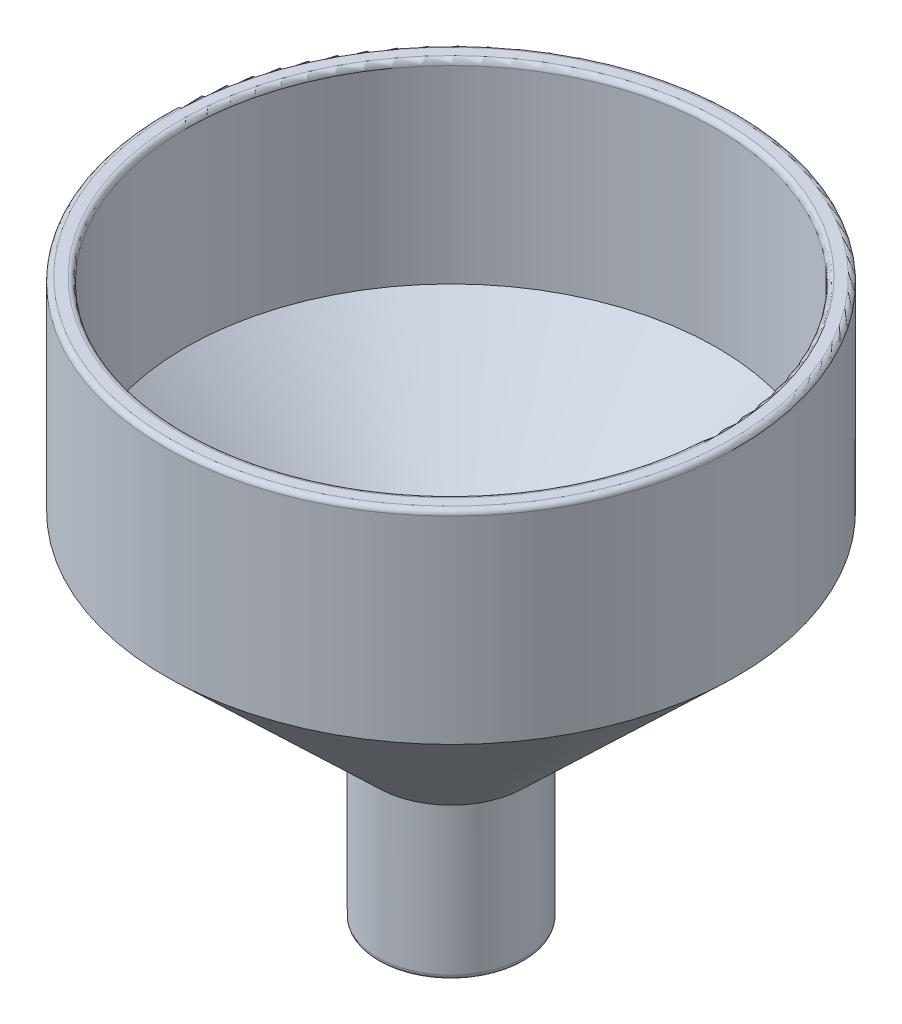
ISO-10303-21;
HEADER;
FILE_DESCRIPTION(('STEP AP214'),'2;1');
FILE_NAME('part.step','',(''),(''),'','','');
FILE_SCHEMA(('AUTOMOTIVE_DESIGN { 1 0 10303 214 1 1 1 1 }'));
ENDSEC;
DATA;
#1=APPLICATION_CONTEXT('core data for automotive mechanical design processes');
#2=APPLICATION_PROTOCOL_DEFINITION('international standard','automotive_design',2000,#1);
#3=PRODUCT_CONTEXT('',#1,'mechanical');
#4=PRODUCT('Part','Part','',(#3));
#5=PRODUCT_RELATED_PRODUCT_CATEGORY('part','',(#4));
#6=PRODUCT_DEFINITION_FORMATION('','',#4);
#7=PRODUCT_DEFINITION_CONTEXT('part definition',#1,'design');
#8=PRODUCT_DEFINITION('design','',#6,#7);
#9=PRODUCT_DEFINITION_SHAPE('','',#8);
#10=(LENGTH_UNIT() NAMED_UNIT(*) SI_UNIT(.MILLI.,.METRE.));
#11=(NAMED_UNIT(*) PLANE_ANGLE_UNIT() SI_UNIT($,.RADIAN.));
#12=(NAMED_UNIT(*) SI_UNIT($,.STERADIAN.) SOLID_ANGLE_UNIT());
#13=UNCERTAINTY_MEASURE_WITH_UNIT(LENGTH_MEASURE(1.E-05),#10,'distance_accuracy_value','');
#14=(GEOMETRIC_REPRESENTATION_CONTEXT(3) GLOBAL_UNCERTAINTY_ASSIGNED_CONTEXT((#13)) GLOBAL_UNIT_ASSIGNED_CONTEXT((#10,
#11,#12)) REPRESENTATION_CONTEXT('',''));
#15=CARTESIAN_POINT('',(0.,0.,0.));
#16=DIRECTION('',(0.,0.,1.));
#17=DIRECTION('',(1.,0.,0.));
#18=AXIS2_PLACEMENT_3D('',#15,#16,#17);
#19=CARTESIAN_POINT('',(-7.25,15.0833069396014,0.));
#20=DIRECTION('',(0.,1.,0.));
#21=DIRECTION('',(0.,0.,1.));
#22=AXIS2_PLACEMENT_3D('',#19,#20,#21);
#23=PLANE('',#22);
#24=CARTESIAN_POINT('',(0.,15.0833069396014,0.));
#25=DIRECTION('',(0.,1.,0.));
#26=DIRECTION('',(0.,0.,1.));
#27=AXIS2_PLACEMENT_3D('',#24,#25,#26);
#28=CIRCLE('',#27,5.75);
#29=CARTESIAN_POINT('',(0.,15.0833069396014,5.75));
#30=VERTEX_POINT('',#29);
#31=EDGE_CURVE('E53',#30,#30,#28,.T.);
#32=ORIENTED_EDGE('',*,*,#31,.T.);
#33=EDGE_LOOP('',(#32));
#34=FACE_BOUND('',#33,.T.);
#35=CARTESIAN_POINT('',(0.,15.0833069396014,0.));
#36=DIRECTION('',(0.,1.,0.));
#37=DIRECTION('',(0.,0.,1.));
#38=AXIS2_PLACEMENT_3D('',#35,#36,#37);
#39=CIRCLE('',#38,6.75);
#40=CARTESIAN_POINT('',(0.,15.0833069396014,6.75));
#41=VERTEX_POINT('',#40);
#42=EDGE_CURVE('E56',#41,#41,#39,.F.);
#43=ORIENTED_EDGE('',*,*,#42,.T.);
#44=EDGE_LOOP('',(#43));
#45=FACE_BOUND('',#44,.T.);
#46=ADVANCED_FACE('F30',(#34,#45),#23,.F.);
#47=CARTESIAN_POINT('',(0.,0.,0.));
#48=DIRECTION('',(0.,-1.,0.));
#49=DIRECTION('',(0.,0.,-1.));
#50=AXIS2_PLACEMENT_3D('',#47,#48,#49);
#51=CYLINDRICAL_SURFACE('',#50,5.25);
#52=CARTESIAN_POINT('',(0.,15.5833069396014,0.));
#53=DIRECTION('',(0.,1.,0.));
#54=DIRECTION('',(0.,0.,1.));
#55=AXIS2_PLACEMENT_3D('',#52,#53,#54);
#56=CIRCLE('',#55,5.25);
#57=CARTESIAN_POINT('',(0.,15.5833069396014,5.25));
#58=VERTEX_POINT('',#57);
#59=EDGE_CURVE('E59',#58,#58,#56,.F.);
#60=ORIENTED_EDGE('',*,*,#59,.T.);
#61=EDGE_LOOP('',(#60));
#62=FACE_BOUND('',#61,.T.);
#63=CARTESIAN_POINT('',(0.,30.939040937703,0.));
#64=DIRECTION('',(0.,-1.,0.));
#65=DIRECTION('',(0.,0.,-1.));
#66=AXIS2_PLACEMENT_3D('',#63,#64,#65);
#67=CIRCLE('',#66,5.25);
#68=CARTESIAN_POINT('',(0.,30.939040937703,-5.25));
#69=VERTEX_POINT('',#68);
#70=EDGE_CURVE('E62',#69,#69,#67,.T.);
#71=ORIENTED_EDGE('',*,*,#70,.F.);
#72=EDGE_LOOP('',(#71));
#73=FACE_BOUND('',#72,.T.);
#74=ADVANCED_FACE('F94',(#62,#73),#51,.F.);
#75=CARTESIAN_POINT('',(0.,30.939040937703,0.));
#76=DIRECTION('',(0.,1.,0.));
#77=DIRECTION('',(0.,0.,1.));
#78=AXIS2_PLACEMENT_3D('',#75,#76,#77);
#79=CONICAL_SURFACE('',#78,5.25,0.808593026076289);
#80=CARTESIAN_POINT('',(0.,50.939040937703,0.));
#81=DIRECTION('',(0.,-1.,0.));
#82=DIRECTION('',(0.,0.,-1.));
#83=AXIS2_PLACEMENT_3D('',#80,#81,#82);
#84=CIRCLE('',#83,26.2);
#85=CARTESIAN_POINT('',(0.,50.939040937703,-26.2));
#86=VERTEX_POINT('',#85);
#87=EDGE_CURVE('E65',#86,#86,#84,.T.);
#88=ORIENTED_EDGE('',*,*,#87,.F.);
#89=EDGE_LOOP('',(#88));
#90=FACE_BOUND('',#89,.T.);
#91=ORIENTED_EDGE('',*,*,#70,.T.);
#92=EDGE_LOOP('',(#91));
#93=FACE_BOUND('',#92,.T.);
#94=ADVANCED_FACE('F100',(#90,#93),#79,.F.);
#95=CARTESIAN_POINT('',(0.,0.,0.));
#96=DIRECTION('',(0.,-1.,0.));
#97=DIRECTION('',(0.,0.,-1.));
#98=AXIS2_PLACEMENT_3D('',#95,#96,#97);
#99=CYLINDRICAL_SURFACE('',#98,26.2);
#100=CARTESIAN_POINT('',(0.,69.5833069396014,0.));
#101=DIRECTION('',(0.,-1.,0.));
#102=DIRECTION('',(0.,0.,-1.));
#103=AXIS2_PLACEMENT_3D('',#100,#101,#102);
#104=CIRCLE('',#103,26.2);
#105=CARTESIAN_POINT('',(0.,69.5833069396014,-26.2));
#106=VERTEX_POINT('',#105);
#107=EDGE_CURVE('E37',#106,#106,#104,.F.);
#108=ORIENTED_EDGE('',*,*,#107,.T.);
#109=EDGE_LOOP('',(#108));
#110=FACE_BOUND('',#109,.T.);
#111=ORIENTED_EDGE('',*,*,#87,.T.);
#112=EDGE_LOOP('',(#111));
#113=FACE_BOUND('',#112,.T.);
#114=ADVANCED_FACE('F90',(#110,#113),#99,.F.);
#115=CARTESIAN_POINT('',(-26.2,70.0833069396014,0.));
#116=DIRECTION('',(0.,-1.,0.));
#117=DIRECTION('',(0.,0.,-1.));
#118=AXIS2_PLACEMENT_3D('',#115,#116,#117);
#119=PLANE('',#118);
#120=CARTESIAN_POINT('',(0.,70.0833069396014,0.));
#121=DIRECTION('',(0.,-1.,0.));
#122=DIRECTION('',(0.,0.,-1.));
#123=AXIS2_PLACEMENT_3D('',#120,#121,#122);
#124=CIRCLE('',#123,26.7);
#125=CARTESIAN_POINT('',(0.,70.0833069396014,-26.7));
#126=VERTEX_POINT('',#125);
#127=EDGE_CURVE('E41',#126,#126,#124,.T.);
#128=ORIENTED_EDGE('',*,*,#127,.T.);
#129=EDGE_LOOP('',(#128));
#130=FACE_BOUND('',#129,.T.);
#131=CARTESIAN_POINT('',(0.,70.0833069396014,0.));
#132=DIRECTION('',(0.,-1.,0.));
#133=DIRECTION('',(0.,0.,-1.));
#134=AXIS2_PLACEMENT_3D('',#131,#132,#133);
#135=CIRCLE('',#134,27.7);
#136=CARTESIAN_POINT('',(0.,70.0833069396014,-27.7));
#137=VERTEX_POINT('',#136);
#138=EDGE_CURVE('E45',#137,#137,#135,.F.);
#139=ORIENTED_EDGE('',*,*,#138,.T.);
#140=EDGE_LOOP('',(#139));
#141=FACE_BOUND('',#140,.T.);
#142=ADVANCED_FACE('F85',(#130,#141),#119,.F.);
#143=CARTESIAN_POINT('',(0.,0.,0.));
#144=DIRECTION('',(0.,-1.,0.));
#145=DIRECTION('',(0.,0.,-1.));
#146=AXIS2_PLACEMENT_3D('',#143,#144,#145);
#147=CYLINDRICAL_SURFACE('',#146,28.2);
#148=CARTESIAN_POINT('',(0.,69.5833069396014,0.));
#149=DIRECTION('',(0.,-1.,0.));
#150=DIRECTION('',(0.,0.,-1.));
#151=AXIS2_PLACEMENT_3D('',#148,#149,#150);
#152=CIRCLE('',#151,28.2);
#153=CARTESIAN_POINT('',(0.,69.5833069396014,-28.2));
#154=VERTEX_POINT('',#153);
#155=EDGE_CURVE('E10',#154,#154,#152,.T.);
#156=ORIENTED_EDGE('',*,*,#155,.T.);
#157=EDGE_LOOP('',(#156));
#158=FACE_BOUND('',#157,.T.);
#159=CARTESIAN_POINT('',(0.,50.0833069396014,0.));
#160=DIRECTION('',(0.,-1.,0.));
#161=DIRECTION('',(0.,0.,-1.));
#162=AXIS2_PLACEMENT_3D('',#159,#160,#161);
#163=CIRCLE('',#162,28.2);
#164=CARTESIAN_POINT('',(0.,50.0833069396014,-28.2));
#165=VERTEX_POINT('',#164);
#166=EDGE_CURVE('E68',#165,#165,#163,.T.);
#167=ORIENTED_EDGE('',*,*,#166,.F.);
#168=EDGE_LOOP('',(#167));
#169=FACE_BOUND('',#168,.T.);
#170=ADVANCED_FACE('F80',(#158,#169),#147,.T.);
#171=CARTESIAN_POINT('',(0.,50.0833069396014,0.));
#172=DIRECTION('',(0.,1.,0.));
#173=DIRECTION('',(0.,0.,1.));
#174=AXIS2_PLACEMENT_3D('',#171,#172,#173);
#175=CONICAL_SURFACE('',#174,28.2,0.808593026076289);
#176=CARTESIAN_POINT('',(0.,30.0833069396014,0.));
#177=DIRECTION('',(0.,-1.,0.));
#178=DIRECTION('',(0.,0.,-1.));
#179=AXIS2_PLACEMENT_3D('',#176,#177,#178);
#180=CIRCLE('',#179,7.25);
#181=CARTESIAN_POINT('',(0.,30.0833069396014,-7.25));
#182=VERTEX_POINT('',#181);
#183=EDGE_CURVE('E71',#182,#182,#180,.T.);
#184=ORIENTED_EDGE('',*,*,#183,.F.);
#185=EDGE_LOOP('',(#184));
#186=FACE_BOUND('',#185,.T.);
#187=ORIENTED_EDGE('',*,*,#166,.T.);
#188=EDGE_LOOP('',(#187));
#189=FACE_BOUND('',#188,.T.);
#190=ADVANCED_FACE('F77',(#186,#189),#175,.T.);
#191=CARTESIAN_POINT('',(0.,0.,0.));
#192=DIRECTION('',(0.,-1.,0.));
#193=DIRECTION('',(0.,0.,-1.));
#194=AXIS2_PLACEMENT_3D('',#191,#192,#193);
#195=CYLINDRICAL_SURFACE('',#194,7.25);
#196=CARTESIAN_POINT('',(0.,15.5833069396014,0.));
#197=DIRECTION('',(0.,1.,0.));
#198=DIRECTION('',(0.,0.,1.));
#199=AXIS2_PLACEMENT_3D('',#196,#197,#198);
#200=CIRCLE('',#199,7.25);
#201=CARTESIAN_POINT('',(0.,15.5833069396014,7.25));
#202=VERTEX_POINT('',#201);
#203=EDGE_CURVE('E50',#202,#202,#200,.T.);
#204=ORIENTED_EDGE('',*,*,#203,.T.);
#205=EDGE_LOOP('',(#204));
#206=FACE_BOUND('',#205,.T.);
#207=ORIENTED_EDGE('',*,*,#183,.T.);
#208=EDGE_LOOP('',(#207));
#209=FACE_BOUND('',#208,.T.);
#210=ADVANCED_FACE('F75',(#206,#209),#195,.T.);
#211=CARTESIAN_POINT('',(0.,15.5833069396014,0.));
#212=DIRECTION('',(0.,1.,0.));
#213=DIRECTION('',(0.,0.,1.));
#214=AXIS2_PLACEMENT_3D('',#211,#212,#213);
#215=TOROIDAL_SURFACE('',#214,5.75,0.5);
#216=ORIENTED_EDGE('',*,*,#31,.F.);
#217=EDGE_LOOP('',(#216));
#218=FACE_BOUND('',#217,.T.);
#219=ORIENTED_EDGE('',*,*,#59,.F.);
#220=EDGE_LOOP('',(#219));
#221=FACE_BOUND('',#220,.T.);
#222=ADVANCED_FACE('F106',(#218,#221),#215,.T.);
#223=CARTESIAN_POINT('',(0.,15.5833069396014,0.));
#224=DIRECTION('',(0.,1.,0.));
#225=DIRECTION('',(0.,0.,1.));
#226=AXIS2_PLACEMENT_3D('',#223,#224,#225);
#227=TOROIDAL_SURFACE('',#226,6.75,0.5);
#228=ORIENTED_EDGE('',*,*,#203,.F.);
#229=EDGE_LOOP('',(#228));
#230=FACE_BOUND('',#229,.T.);
#231=ORIENTED_EDGE('',*,*,#42,.F.);
#232=EDGE_LOOP('',(#231));
#233=FACE_BOUND('',#232,.T.);
#234=ADVANCED_FACE('F109',(#230,#233),#227,.T.);
#235=CARTESIAN_POINT('',(0.,69.5833069396014,0.));
#236=DIRECTION('',(0.,-1.,0.));
#237=DIRECTION('',(0.,0.,-1.));
#238=AXIS2_PLACEMENT_3D('',#235,#236,#237);
#239=TOROIDAL_SURFACE('',#238,26.7,0.5);
#240=ORIENTED_EDGE('',*,*,#107,.F.);
#241=EDGE_LOOP('',(#240));
#242=FACE_BOUND('',#241,.T.);
#243=ORIENTED_EDGE('',*,*,#127,.F.);
#244=EDGE_LOOP('',(#243));
#245=FACE_BOUND('',#244,.T.);
#246=ADVANCED_FACE('F112',(#242,#245),#239,.T.);
#247=CARTESIAN_POINT('',(0.,69.5833069396014,0.));
#248=DIRECTION('',(0.,-1.,0.));
#249=DIRECTION('',(0.,0.,-1.));
#250=AXIS2_PLACEMENT_3D('',#247,#248,#249);
#251=TOROIDAL_SURFACE('',#250,27.7,0.5);
#252=ORIENTED_EDGE('',*,*,#138,.F.);
#253=EDGE_LOOP('',(#252));
#254=FACE_BOUND('',#253,.T.);
#255=ORIENTED_EDGE('',*,*,#155,.F.);
#256=EDGE_LOOP('',(#255));
#257=FACE_BOUND('',#256,.T.);
#258=ADVANCED_FACE('F32',(#254,#257),#251,.T.);
#259=CLOSED_SHELL('',(#46,#74,#94,#114,#142,#170,#190,#210,#222,#234,#246,#258));
#260=MANIFOLD_SOLID_BREP('B2',#259);
#261=ADVANCED_BREP_SHAPE_REPRESENTATION('',(#18,#260),#14);
#262=SHAPE_DEFINITION_REPRESENTATION(#9,#261);
ENDSEC;
END-ISO-10303-21;
